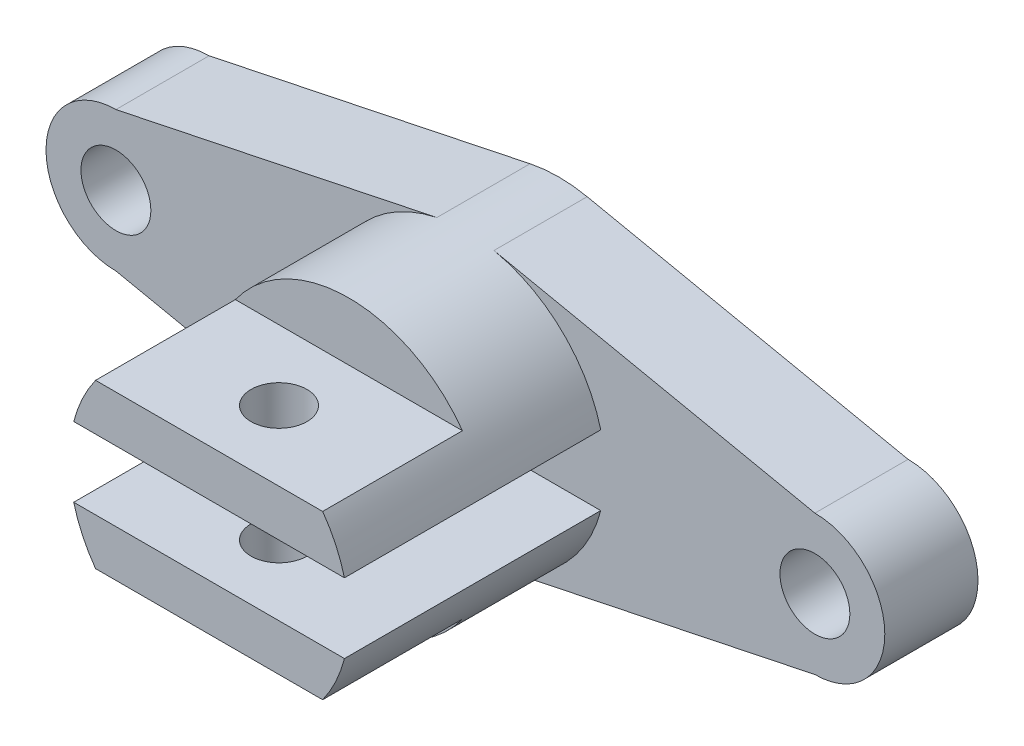
ISO-10303-21;
HEADER;
FILE_DESCRIPTION(('STEP AP214'),'2;1');
FILE_NAME('part.step','',(''),(''),'','','');
FILE_SCHEMA(('AUTOMOTIVE_DESIGN { 1 0 10303 214 1 1 1 1 }'));
ENDSEC;
DATA;
#1=APPLICATION_CONTEXT('core data for automotive mechanical design processes');
#2=APPLICATION_PROTOCOL_DEFINITION('international standard','automotive_design',2000,#1);
#3=PRODUCT_CONTEXT('',#1,'mechanical');
#4=PRODUCT('Part','Part','',(#3));
#5=PRODUCT_RELATED_PRODUCT_CATEGORY('part','',(#4));
#6=PRODUCT_DEFINITION_FORMATION('','',#4);
#7=PRODUCT_DEFINITION_CONTEXT('part definition',#1,'design');
#8=PRODUCT_DEFINITION('design','',#6,#7);
#9=PRODUCT_DEFINITION_SHAPE('','',#8);
#10=(LENGTH_UNIT() NAMED_UNIT(*) SI_UNIT(.MILLI.,.METRE.));
#11=(NAMED_UNIT(*) PLANE_ANGLE_UNIT() SI_UNIT($,.RADIAN.));
#12=(NAMED_UNIT(*) SI_UNIT($,.STERADIAN.) SOLID_ANGLE_UNIT());
#13=UNCERTAINTY_MEASURE_WITH_UNIT(LENGTH_MEASURE(1.E-05),#10,'distance_accuracy_value','');
#14=(GEOMETRIC_REPRESENTATION_CONTEXT(3) GLOBAL_UNCERTAINTY_ASSIGNED_CONTEXT((#13)) GLOBAL_UNIT_ASSIGNED_CONTEXT((#10,
#11,#12)) REPRESENTATION_CONTEXT('',''));
#15=CARTESIAN_POINT('',(0.,0.,0.));
#16=DIRECTION('',(0.,0.,1.));
#17=DIRECTION('',(1.,0.,0.));
#18=AXIS2_PLACEMENT_3D('',#15,#16,#17);
#19=CARTESIAN_POINT('',(-6.12644335404989,29.3677832297506,20.));
#20=DIRECTION('',(-0.20421477846833,0.978926107658352,0.));
#21=DIRECTION('',(-0.978926107658352,-0.20421477846833,0.));
#22=AXIS2_PLACEMENT_3D('',#19,#20,#21);
#23=PLANE('',#22);
#24=DIRECTION('',(0.978926107658352,0.20421477846833,0.));
#25=VECTOR('',#24,1.);
#26=CARTESIAN_POINT('',(-6.12644335404989,29.3677832297506,0.));
#27=LINE('',#26,#25);
#28=CARTESIAN_POINT('',(-75.,15.,0.));
#29=VERTEX_POINT('',#28);
#30=CARTESIAN_POINT('',(-6.12644335404989,29.3677832297506,0.));
#31=VERTEX_POINT('',#30);
#32=EDGE_CURVE('E222',#29,#31,#27,.T.);
#33=ORIENTED_EDGE('',*,*,#32,.F.);
#34=DIRECTION('',(0.,0.,-1.));
#35=VECTOR('',#34,1.);
#36=CARTESIAN_POINT('',(-75.,15.,20.));
#37=LINE('',#36,#35);
#38=CARTESIAN_POINT('',(-75.,15.,20.));
#39=VERTEX_POINT('',#38);
#40=EDGE_CURVE('E56',#39,#29,#37,.T.);
#41=ORIENTED_EDGE('',*,*,#40,.F.);
#42=DIRECTION('',(0.978926107658352,0.20421477846833,0.));
#43=VECTOR('',#42,1.);
#44=CARTESIAN_POINT('',(-6.12644335404989,29.3677832297506,20.));
#45=LINE('',#44,#43);
#46=CARTESIAN_POINT('',(-6.12644335404989,29.3677832297506,20.));
#47=VERTEX_POINT('',#46);
#48=EDGE_CURVE('E232',#39,#47,#45,.T.);
#49=ORIENTED_EDGE('',*,*,#48,.T.);
#50=DIRECTION('',(0.,0.,-1.));
#51=VECTOR('',#50,1.);
#52=CARTESIAN_POINT('',(-6.12644335404989,29.3677832297506,20.));
#53=LINE('',#52,#51);
#54=EDGE_CURVE('E11',#47,#31,#53,.T.);
#55=ORIENTED_EDGE('',*,*,#54,.T.);
#56=EDGE_LOOP('',(#33,#41,#49,#55));
#57=FACE_BOUND('',#56,.T.);
#58=ADVANCED_FACE('F46',(#57),#23,.T.);
#59=CARTESIAN_POINT('',(-75.,0.,20.));
#60=DIRECTION('',(0.,0.,-1.));
#61=DIRECTION('',(-1.,0.,0.));
#62=AXIS2_PLACEMENT_3D('',#59,#60,#61);
#63=CYLINDRICAL_SURFACE('',#62,15.);
#64=CARTESIAN_POINT('',(-75.,0.,0.));
#65=DIRECTION('',(0.,0.,1.));
#66=DIRECTION('',(1.,0.,0.));
#67=AXIS2_PLACEMENT_3D('',#64,#65,#66);
#68=CIRCLE('',#67,15.);
#69=CARTESIAN_POINT('',(-75.,-15.,0.));
#70=VERTEX_POINT('',#69);
#71=EDGE_CURVE('E261',#29,#70,#68,.T.);
#72=ORIENTED_EDGE('',*,*,#71,.T.);
#73=DIRECTION('',(0.,0.,-1.));
#74=VECTOR('',#73,1.);
#75=CARTESIAN_POINT('',(-75.,-15.,20.));
#76=LINE('',#75,#74);
#77=CARTESIAN_POINT('',(-75.,-15.,20.));
#78=VERTEX_POINT('',#77);
#79=EDGE_CURVE('E299',#78,#70,#76,.T.);
#80=ORIENTED_EDGE('',*,*,#79,.F.);
#81=CARTESIAN_POINT('',(-75.,0.,20.));
#82=DIRECTION('',(0.,0.,1.));
#83=DIRECTION('',(1.,0.,0.));
#84=AXIS2_PLACEMENT_3D('',#81,#82,#83);
#85=CIRCLE('',#84,15.);
#86=EDGE_CURVE('E236',#39,#78,#85,.T.);
#87=ORIENTED_EDGE('',*,*,#86,.F.);
#88=ORIENTED_EDGE('',*,*,#40,.T.);
#89=EDGE_LOOP('',(#72,#80,#87,#88));
#90=FACE_BOUND('',#89,.T.);
#91=ADVANCED_FACE('F307',(#90),#63,.T.);
#92=CARTESIAN_POINT('',(-6.12644335404988,-29.3677832297505,20.));
#93=DIRECTION('',(0.204214778468329,0.978926107658352,0.));
#94=DIRECTION('',(-0.978926107658352,0.204214778468329,0.));
#95=AXIS2_PLACEMENT_3D('',#92,#93,#94);
#96=PLANE('',#95);
#97=DIRECTION('',(0.978926107658352,-0.204214778468329,0.));
#98=VECTOR('',#97,1.);
#99=CARTESIAN_POINT('',(-6.12644335404988,-29.3677832297505,0.));
#100=LINE('',#99,#98);
#101=CARTESIAN_POINT('',(-6.12644335404989,-29.3677832297505,0.));
#102=VERTEX_POINT('',#101);
#103=EDGE_CURVE('E264',#70,#102,#100,.T.);
#104=ORIENTED_EDGE('',*,*,#103,.T.);
#105=DIRECTION('',(0.,0.,-1.));
#106=VECTOR('',#105,1.);
#107=CARTESIAN_POINT('',(-6.12644335404989,-29.3677832297505,20.));
#108=LINE('',#107,#106);
#109=CARTESIAN_POINT('',(-6.12644335404988,-29.3677832297505,20.));
#110=VERTEX_POINT('',#109);
#111=EDGE_CURVE('E295',#110,#102,#108,.T.);
#112=ORIENTED_EDGE('',*,*,#111,.F.);
#113=DIRECTION('',(0.978926107658352,-0.204214778468329,0.));
#114=VECTOR('',#113,1.);
#115=CARTESIAN_POINT('',(-6.12644335404988,-29.3677832297505,20.));
#116=LINE('',#115,#114);
#117=EDGE_CURVE('E239',#78,#110,#116,.T.);
#118=ORIENTED_EDGE('',*,*,#117,.F.);
#119=ORIENTED_EDGE('',*,*,#79,.T.);
#120=EDGE_LOOP('',(#104,#112,#118,#119));
#121=FACE_BOUND('',#120,.T.);
#122=ADVANCED_FACE('F385',(#121),#96,.F.);
#123=CARTESIAN_POINT('',(6.12644335404989,-29.3677832297506,20.));
#124=DIRECTION('',(0.20421477846833,-0.978926107658352,0.));
#125=DIRECTION('',(0.978926107658352,0.20421477846833,0.));
#126=AXIS2_PLACEMENT_3D('',#123,#124,#125);
#127=PLANE('',#126);
#128=DIRECTION('',(-0.978926107658352,-0.20421477846833,0.));
#129=VECTOR('',#128,1.);
#130=CARTESIAN_POINT('',(6.12644335404989,-29.3677832297506,0.));
#131=LINE('',#130,#129);
#132=CARTESIAN_POINT('',(75.,-15.,0.));
#133=VERTEX_POINT('',#132);
#134=CARTESIAN_POINT('',(6.12644335404989,-29.3677832297506,0.));
#135=VERTEX_POINT('',#134);
#136=EDGE_CURVE('E268',#133,#135,#131,.T.);
#137=ORIENTED_EDGE('',*,*,#136,.F.);
#138=DIRECTION('',(0.,0.,-1.));
#139=VECTOR('',#138,1.);
#140=CARTESIAN_POINT('',(75.,-15.,20.));
#141=LINE('',#140,#139);
#142=CARTESIAN_POINT('',(75.,-15.,20.));
#143=VERTEX_POINT('',#142);
#144=EDGE_CURVE('E290',#143,#133,#141,.T.);
#145=ORIENTED_EDGE('',*,*,#144,.F.);
#146=DIRECTION('',(-0.978926107658352,-0.20421477846833,0.));
#147=VECTOR('',#146,1.);
#148=CARTESIAN_POINT('',(6.12644335404989,-29.3677832297506,20.));
#149=LINE('',#148,#147);
#150=CARTESIAN_POINT('',(6.12644335404989,-29.3677832297506,20.));
#151=VERTEX_POINT('',#150);
#152=EDGE_CURVE('E136',#143,#151,#149,.T.);
#153=ORIENTED_EDGE('',*,*,#152,.T.);
#154=DIRECTION('',(0.,0.,-1.));
#155=VECTOR('',#154,1.);
#156=CARTESIAN_POINT('',(6.12644335404989,-29.3677832297506,20.));
#157=LINE('',#156,#155);
#158=EDGE_CURVE('E133',#151,#135,#157,.T.);
#159=ORIENTED_EDGE('',*,*,#158,.T.);
#160=EDGE_LOOP('',(#137,#145,#153,#159));
#161=FACE_BOUND('',#160,.T.);
#162=ADVANCED_FACE('F389',(#161),#127,.T.);
#163=CARTESIAN_POINT('',(75.,0.,20.));
#164=DIRECTION('',(0.,0.,-1.));
#165=DIRECTION('',(-1.,0.,0.));
#166=AXIS2_PLACEMENT_3D('',#163,#164,#165);
#167=CYLINDRICAL_SURFACE('',#166,15.);
#168=CARTESIAN_POINT('',(75.,0.,0.));
#169=DIRECTION('',(0.,0.,1.));
#170=DIRECTION('',(1.,0.,0.));
#171=AXIS2_PLACEMENT_3D('',#168,#169,#170);
#172=CIRCLE('',#171,15.);
#173=CARTESIAN_POINT('',(75.,15.,0.));
#174=VERTEX_POINT('',#173);
#175=EDGE_CURVE('E87',#133,#174,#172,.T.);
#176=ORIENTED_EDGE('',*,*,#175,.T.);
#177=DIRECTION('',(0.,0.,-1.));
#178=VECTOR('',#177,1.);
#179=CARTESIAN_POINT('',(75.,15.,20.));
#180=LINE('',#179,#178);
#181=CARTESIAN_POINT('',(75.,15.,20.));
#182=VERTEX_POINT('',#181);
#183=EDGE_CURVE('E287',#182,#174,#180,.T.);
#184=ORIENTED_EDGE('',*,*,#183,.F.);
#185=CARTESIAN_POINT('',(75.,0.,20.));
#186=DIRECTION('',(0.,0.,1.));
#187=DIRECTION('',(1.,0.,0.));
#188=AXIS2_PLACEMENT_3D('',#185,#186,#187);
#189=CIRCLE('',#188,15.);
#190=EDGE_CURVE('E64',#143,#182,#189,.T.);
#191=ORIENTED_EDGE('',*,*,#190,.F.);
#192=ORIENTED_EDGE('',*,*,#144,.T.);
#193=EDGE_LOOP('',(#176,#184,#191,#192));
#194=FACE_BOUND('',#193,.T.);
#195=ADVANCED_FACE('F395',(#194),#167,.T.);
#196=CARTESIAN_POINT('',(-75.,0.,20.));
#197=DIRECTION('',(0.,0.,-1.));
#198=DIRECTION('',(-1.,0.,0.));
#199=AXIS2_PLACEMENT_3D('',#196,#197,#198);
#200=CYLINDRICAL_SURFACE('',#199,7.5);
#201=CARTESIAN_POINT('',(-75.,0.,20.));
#202=DIRECTION('',(0.,0.,1.));
#203=DIRECTION('',(1.,0.,0.));
#204=AXIS2_PLACEMENT_3D('',#201,#202,#203);
#205=CIRCLE('',#204,7.5);
#206=CARTESIAN_POINT('',(-67.5,0.,20.));
#207=VERTEX_POINT('',#206);
#208=EDGE_CURVE('E250',#207,#207,#205,.T.);
#209=ORIENTED_EDGE('',*,*,#208,.T.);
#210=EDGE_LOOP('',(#209));
#211=FACE_BOUND('',#210,.T.);
#212=CARTESIAN_POINT('',(-75.,0.,0.));
#213=DIRECTION('',(0.,0.,1.));
#214=DIRECTION('',(1.,0.,0.));
#215=AXIS2_PLACEMENT_3D('',#212,#213,#214);
#216=CIRCLE('',#215,7.5);
#217=CARTESIAN_POINT('',(-67.5,0.,0.));
#218=VERTEX_POINT('',#217);
#219=EDGE_CURVE('E278',#218,#218,#216,.T.);
#220=ORIENTED_EDGE('',*,*,#219,.F.);
#221=EDGE_LOOP('',(#220));
#222=FACE_BOUND('',#221,.T.);
#223=ADVANCED_FACE('F398',(#211,#222),#200,.F.);
#224=CARTESIAN_POINT('',(6.12644335404989,29.3677832297506,20.));
#225=DIRECTION('',(-0.20421477846833,-0.978926107658352,0.));
#226=DIRECTION('',(0.978926107658352,-0.20421477846833,0.));
#227=AXIS2_PLACEMENT_3D('',#224,#225,#226);
#228=PLANE('',#227);
#229=DIRECTION('',(-0.978926107658352,0.20421477846833,0.));
#230=VECTOR('',#229,1.);
#231=CARTESIAN_POINT('',(6.12644335404989,29.3677832297506,0.));
#232=LINE('',#231,#230);
#233=CARTESIAN_POINT('',(6.12644335404989,29.3677832297506,0.));
#234=VERTEX_POINT('',#233);
#235=EDGE_CURVE('E274',#174,#234,#232,.T.);
#236=ORIENTED_EDGE('',*,*,#235,.T.);
#237=DIRECTION('',(0.,0.,-1.));
#238=VECTOR('',#237,1.);
#239=CARTESIAN_POINT('',(6.12644335404989,29.3677832297506,20.));
#240=LINE('',#239,#238);
#241=CARTESIAN_POINT('',(6.12644335404989,29.3677832297506,20.));
#242=VERTEX_POINT('',#241);
#243=EDGE_CURVE('E258',#242,#234,#240,.T.);
#244=ORIENTED_EDGE('',*,*,#243,.F.);
#245=DIRECTION('',(-0.978926107658352,0.20421477846833,0.));
#246=VECTOR('',#245,1.);
#247=CARTESIAN_POINT('',(6.12644335404989,29.3677832297506,20.));
#248=LINE('',#247,#246);
#249=EDGE_CURVE('E247',#182,#242,#248,.T.);
#250=ORIENTED_EDGE('',*,*,#249,.F.);
#251=ORIENTED_EDGE('',*,*,#183,.T.);
#252=EDGE_LOOP('',(#236,#244,#250,#251));
#253=FACE_BOUND('',#252,.T.);
#254=ADVANCED_FACE('F399',(#253),#228,.F.);
#255=CARTESIAN_POINT('',(75.,0.,20.));
#256=DIRECTION('',(0.,0.,-1.));
#257=DIRECTION('',(-1.,0.,0.));
#258=AXIS2_PLACEMENT_3D('',#255,#256,#257);
#259=CYLINDRICAL_SURFACE('',#258,7.5);
#260=CARTESIAN_POINT('',(75.,0.,20.));
#261=DIRECTION('',(0.,0.,1.));
#262=DIRECTION('',(1.,0.,0.));
#263=AXIS2_PLACEMENT_3D('',#260,#261,#262);
#264=CIRCLE('',#263,7.5);
#265=CARTESIAN_POINT('',(82.5,0.,20.));
#266=VERTEX_POINT('',#265);
#267=EDGE_CURVE('E254',#266,#266,#264,.T.);
#268=ORIENTED_EDGE('',*,*,#267,.T.);
#269=EDGE_LOOP('',(#268));
#270=FACE_BOUND('',#269,.T.);
#271=CARTESIAN_POINT('',(75.,0.,0.));
#272=DIRECTION('',(0.,0.,1.));
#273=DIRECTION('',(1.,0.,0.));
#274=AXIS2_PLACEMENT_3D('',#271,#272,#273);
#275=CIRCLE('',#274,7.5);
#276=CARTESIAN_POINT('',(82.5,0.,0.));
#277=VERTEX_POINT('',#276);
#278=EDGE_CURVE('E228',#277,#277,#275,.T.);
#279=ORIENTED_EDGE('',*,*,#278,.F.);
#280=EDGE_LOOP('',(#279));
#281=FACE_BOUND('',#280,.T.);
#282=ADVANCED_FACE('F402',(#270,#281),#259,.F.);
#283=CARTESIAN_POINT('',(0.,0.,20.));
#284=DIRECTION('',(0.,0.,1.));
#285=DIRECTION('',(1.,0.,0.));
#286=AXIS2_PLACEMENT_3D('',#283,#284,#285);
#287=PLANE('',#286);
#288=CARTESIAN_POINT('',(0.,0.,20.));
#289=DIRECTION('',(0.,0.,1.));
#290=DIRECTION('',(1.,0.,0.));
#291=AXIS2_PLACEMENT_3D('',#288,#289,#290);
#292=CIRCLE('',#291,30.);
#293=CARTESIAN_POINT('',(29.0473750965556,7.5,20.));
#294=VERTEX_POINT('',#293);
#295=EDGE_CURVE('E102',#294,#242,#292,.T.);
#296=ORIENTED_EDGE('',*,*,#295,.F.);
#297=DIRECTION('',(1.,0.,0.));
#298=VECTOR('',#297,1.);
#299=CARTESIAN_POINT('',(0.,7.5,20.));
#300=LINE('',#299,#298);
#301=CARTESIAN_POINT('',(-29.0473750965556,7.5,20.));
#302=VERTEX_POINT('',#301);
#303=EDGE_CURVE('E227',#302,#294,#300,.T.);
#304=ORIENTED_EDGE('',*,*,#303,.F.);
#305=EDGE_CURVE('E229',#47,#302,#292,.T.);
#306=ORIENTED_EDGE('',*,*,#305,.F.);
#307=ORIENTED_EDGE('',*,*,#48,.F.);
#308=ORIENTED_EDGE('',*,*,#86,.T.);
#309=ORIENTED_EDGE('',*,*,#117,.T.);
#310=CARTESIAN_POINT('',(0.,0.,20.));
#311=DIRECTION('',(0.,0.,1.));
#312=DIRECTION('',(1.,0.,0.));
#313=AXIS2_PLACEMENT_3D('',#310,#311,#312);
#314=CIRCLE('',#313,30.);
#315=CARTESIAN_POINT('',(-29.0473750965556,-7.5,20.));
#316=VERTEX_POINT('',#315);
#317=EDGE_CURVE('E139',#316,#110,#314,.T.);
#318=ORIENTED_EDGE('',*,*,#317,.F.);
#319=DIRECTION('',(1.,0.,0.));
#320=VECTOR('',#319,1.);
#321=CARTESIAN_POINT('',(0.,-7.5,20.));
#322=LINE('',#321,#320);
#323=CARTESIAN_POINT('',(29.0473750965556,-7.5,20.));
#324=VERTEX_POINT('',#323);
#325=EDGE_CURVE('E137',#316,#324,#322,.T.);
#326=ORIENTED_EDGE('',*,*,#325,.T.);
#327=EDGE_CURVE('E122',#151,#324,#314,.T.);
#328=ORIENTED_EDGE('',*,*,#327,.F.);
#329=ORIENTED_EDGE('',*,*,#152,.F.);
#330=ORIENTED_EDGE('',*,*,#190,.T.);
#331=ORIENTED_EDGE('',*,*,#249,.T.);
#332=EDGE_LOOP('',(#296,#304,#306,#307,#308,#309,#318,#326,#328,#329,#330,#331));
#333=FACE_BOUND('',#332,.T.);
#334=ORIENTED_EDGE('',*,*,#208,.F.);
#335=EDGE_LOOP('',(#334));
#336=FACE_BOUND('',#335,.T.);
#337=ORIENTED_EDGE('',*,*,#267,.F.);
#338=EDGE_LOOP('',(#337));
#339=FACE_BOUND('',#338,.T.);
#340=ADVANCED_FACE('F141',(#333,#336,#339),#287,.T.);
#341=CARTESIAN_POINT('',(0.,0.,0.));
#342=DIRECTION('',(0.,0.,1.));
#343=DIRECTION('',(1.,0.,0.));
#344=AXIS2_PLACEMENT_3D('',#341,#342,#343);
#345=PLANE('',#344);
#346=ORIENTED_EDGE('',*,*,#32,.T.);
#347=CARTESIAN_POINT('',(0.,0.,0.));
#348=DIRECTION('',(0.,0.,1.));
#349=DIRECTION('',(1.,0.,0.));
#350=AXIS2_PLACEMENT_3D('',#347,#348,#349);
#351=CIRCLE('',#350,30.);
#352=EDGE_CURVE('E95',#234,#31,#351,.T.);
#353=ORIENTED_EDGE('',*,*,#352,.F.);
#354=ORIENTED_EDGE('',*,*,#235,.F.);
#355=ORIENTED_EDGE('',*,*,#175,.F.);
#356=ORIENTED_EDGE('',*,*,#136,.T.);
#357=CARTESIAN_POINT('',(0.,0.,0.));
#358=DIRECTION('',(0.,0.,1.));
#359=DIRECTION('',(1.,0.,0.));
#360=AXIS2_PLACEMENT_3D('',#357,#358,#359);
#361=CIRCLE('',#360,30.);
#362=EDGE_CURVE('E203',#102,#135,#361,.T.);
#363=ORIENTED_EDGE('',*,*,#362,.F.);
#364=ORIENTED_EDGE('',*,*,#103,.F.);
#365=ORIENTED_EDGE('',*,*,#71,.F.);
#366=EDGE_LOOP('',(#346,#353,#354,#355,#356,#363,#364,#365));
#367=FACE_BOUND('',#366,.T.);
#368=ORIENTED_EDGE('',*,*,#219,.T.);
#369=EDGE_LOOP('',(#368));
#370=FACE_BOUND('',#369,.T.);
#371=ORIENTED_EDGE('',*,*,#278,.T.);
#372=EDGE_LOOP('',(#371));
#373=FACE_BOUND('',#372,.T.);
#374=ADVANCED_FACE('F313',(#367,#370,#373),#345,.F.);
#375=CARTESIAN_POINT('',(0.,0.,45.));
#376=DIRECTION('',(0.,0.,-1.));
#377=DIRECTION('',(-1.,0.,0.));
#378=AXIS2_PLACEMENT_3D('',#375,#376,#377);
#379=CYLINDRICAL_SURFACE('',#378,30.);
#380=ORIENTED_EDGE('',*,*,#352,.T.);
#381=ORIENTED_EDGE('',*,*,#54,.F.);
#382=ORIENTED_EDGE('',*,*,#305,.T.);
#383=DIRECTION('',(0.,0.,-1.));
#384=VECTOR('',#383,1.);
#385=CARTESIAN_POINT('',(-29.0473750965556,7.5,75.));
#386=LINE('',#385,#384);
#387=CARTESIAN_POINT('',(-29.0473750965556,7.5,75.));
#388=VERTEX_POINT('',#387);
#389=EDGE_CURVE('E187',#388,#302,#386,.T.);
#390=ORIENTED_EDGE('',*,*,#389,.F.);
#391=CARTESIAN_POINT('',(0.,0.,75.));
#392=DIRECTION('',(0.,0.,1.));
#393=DIRECTION('',(1.,0.,0.));
#394=AXIS2_PLACEMENT_3D('',#391,#392,#393);
#395=CIRCLE('',#394,30.);
#396=CARTESIAN_POINT('',(-24.3669858620224,17.5,75.));
#397=VERTEX_POINT('',#396);
#398=EDGE_CURVE('E183',#397,#388,#395,.T.);
#399=ORIENTED_EDGE('',*,*,#398,.F.);
#400=DIRECTION('',(0.,0.,-1.));
#401=VECTOR('',#400,1.);
#402=CARTESIAN_POINT('',(-24.3669858620224,17.5,75.));
#403=LINE('',#402,#401);
#404=CARTESIAN_POINT('',(-24.3669858620224,17.5,45.));
#405=VERTEX_POINT('',#404);
#406=EDGE_CURVE('E191',#397,#405,#403,.T.);
#407=ORIENTED_EDGE('',*,*,#406,.T.);
#408=CARTESIAN_POINT('',(0.,0.,45.));
#409=DIRECTION('',(0.,0.,1.));
#410=DIRECTION('',(1.,0.,0.));
#411=AXIS2_PLACEMENT_3D('',#408,#409,#410);
#412=CIRCLE('',#411,30.);
#413=CARTESIAN_POINT('',(24.3669858620224,17.5,45.));
#414=VERTEX_POINT('',#413);
#415=EDGE_CURVE('E218',#414,#405,#412,.T.);
#416=ORIENTED_EDGE('',*,*,#415,.F.);
#417=DIRECTION('',(0.,0.,-1.));
#418=VECTOR('',#417,1.);
#419=CARTESIAN_POINT('',(24.3669858620224,17.5,75.));
#420=LINE('',#419,#418);
#421=CARTESIAN_POINT('',(24.3669858620224,17.5,75.));
#422=VERTEX_POINT('',#421);
#423=EDGE_CURVE('E195',#422,#414,#420,.T.);
#424=ORIENTED_EDGE('',*,*,#423,.F.);
#425=CARTESIAN_POINT('',(29.0473750965556,7.5,75.));
#426=VERTEX_POINT('',#425);
#427=EDGE_CURVE('E178',#426,#422,#395,.T.);
#428=ORIENTED_EDGE('',*,*,#427,.F.);
#429=DIRECTION('',(0.,0.,-1.));
#430=VECTOR('',#429,1.);
#431=CARTESIAN_POINT('',(29.0473750965556,7.5,75.));
#432=LINE('',#431,#430);
#433=EDGE_CURVE('E199',#426,#294,#432,.T.);
#434=ORIENTED_EDGE('',*,*,#433,.T.);
#435=ORIENTED_EDGE('',*,*,#295,.T.);
#436=ORIENTED_EDGE('',*,*,#243,.T.);
#437=EDGE_LOOP('',(#380,#381,#382,#390,#399,#407,#416,#424,#428,#434,#435,#436));
#438=FACE_BOUND('',#437,.T.);
#439=ADVANCED_FACE('F322',(#438),#379,.T.);
#440=CARTESIAN_POINT('',(0.,0.,45.));
#441=DIRECTION('',(0.,0.,1.));
#442=DIRECTION('',(1.,0.,0.));
#443=AXIS2_PLACEMENT_3D('',#440,#441,#442);
#444=PLANE('',#443);
#445=DIRECTION('',(-1.,0.,0.));
#446=VECTOR('',#445,1.);
#447=CARTESIAN_POINT('',(0.,17.5,45.));
#448=LINE('',#447,#446);
#449=EDGE_CURVE('E214',#414,#405,#448,.T.);
#450=ORIENTED_EDGE('',*,*,#449,.F.);
#451=ORIENTED_EDGE('',*,*,#415,.T.);
#452=EDGE_LOOP('',(#450,#451));
#453=FACE_BOUND('',#452,.T.);
#454=ADVANCED_FACE('F362',(#453),#444,.T.);
#455=CARTESIAN_POINT('',(0.,0.,45.));
#456=DIRECTION('',(0.,0.,-1.));
#457=DIRECTION('',(-1.,0.,0.));
#458=AXIS2_PLACEMENT_3D('',#455,#456,#457);
#459=CYLINDRICAL_SURFACE('',#458,30.);
#460=ORIENTED_EDGE('',*,*,#362,.T.);
#461=ORIENTED_EDGE('',*,*,#158,.F.);
#462=ORIENTED_EDGE('',*,*,#327,.T.);
#463=DIRECTION('',(0.,0.,-1.));
#464=VECTOR('',#463,1.);
#465=CARTESIAN_POINT('',(29.0473750965556,-7.5,75.));
#466=LINE('',#465,#464);
#467=CARTESIAN_POINT('',(29.0473750965556,-7.5,75.));
#468=VERTEX_POINT('',#467);
#469=EDGE_CURVE('E129',#468,#324,#466,.T.);
#470=ORIENTED_EDGE('',*,*,#469,.F.);
#471=CARTESIAN_POINT('',(0.,0.,75.));
#472=DIRECTION('',(0.,0.,1.));
#473=DIRECTION('',(1.,0.,0.));
#474=AXIS2_PLACEMENT_3D('',#471,#472,#473);
#475=CIRCLE('',#474,30.);
#476=CARTESIAN_POINT('',(24.3669858620224,-17.5,75.));
#477=VERTEX_POINT('',#476);
#478=EDGE_CURVE('E155',#477,#468,#475,.T.);
#479=ORIENTED_EDGE('',*,*,#478,.F.);
#480=DIRECTION('',(0.,0.,-1.));
#481=VECTOR('',#480,1.);
#482=CARTESIAN_POINT('',(24.3669858620224,-17.5,75.));
#483=LINE('',#482,#481);
#484=CARTESIAN_POINT('',(24.3669858620224,-17.5,45.));
#485=VERTEX_POINT('',#484);
#486=EDGE_CURVE('E154',#477,#485,#483,.T.);
#487=ORIENTED_EDGE('',*,*,#486,.T.);
#488=CARTESIAN_POINT('',(0.,0.,45.));
#489=DIRECTION('',(0.,0.,1.));
#490=DIRECTION('',(1.,0.,0.));
#491=AXIS2_PLACEMENT_3D('',#488,#489,#490);
#492=CIRCLE('',#491,30.);
#493=CARTESIAN_POINT('',(-24.3669858620224,-17.5,45.));
#494=VERTEX_POINT('',#493);
#495=EDGE_CURVE('E208',#494,#485,#492,.T.);
#496=ORIENTED_EDGE('',*,*,#495,.F.);
#497=DIRECTION('',(0.,0.,-1.));
#498=VECTOR('',#497,1.);
#499=CARTESIAN_POINT('',(-24.3669858620224,-17.5,75.));
#500=LINE('',#499,#498);
#501=CARTESIAN_POINT('',(-24.3669858620224,-17.5,75.));
#502=VERTEX_POINT('',#501);
#503=EDGE_CURVE('E160',#502,#494,#500,.T.);
#504=ORIENTED_EDGE('',*,*,#503,.F.);
#505=CARTESIAN_POINT('',(-29.0473750965556,-7.5,75.));
#506=VERTEX_POINT('',#505);
#507=EDGE_CURVE('E165',#506,#502,#475,.T.);
#508=ORIENTED_EDGE('',*,*,#507,.F.);
#509=DIRECTION('',(0.,0.,-1.));
#510=VECTOR('',#509,1.);
#511=CARTESIAN_POINT('',(-29.0473750965556,-7.5,75.));
#512=LINE('',#511,#510);
#513=EDGE_CURVE('E171',#506,#316,#512,.T.);
#514=ORIENTED_EDGE('',*,*,#513,.T.);
#515=ORIENTED_EDGE('',*,*,#317,.T.);
#516=ORIENTED_EDGE('',*,*,#111,.T.);
#517=EDGE_LOOP('',(#460,#461,#462,#470,#479,#487,#496,#504,#508,#514,#515,#516));
#518=FACE_BOUND('',#517,.T.);
#519=ADVANCED_FACE('F125',(#518),#459,.T.);
#520=CARTESIAN_POINT('',(0.,0.,45.));
#521=DIRECTION('',(0.,0.,1.));
#522=DIRECTION('',(1.,0.,0.));
#523=AXIS2_PLACEMENT_3D('',#520,#521,#522);
#524=PLANE('',#523);
#525=DIRECTION('',(1.,0.,0.));
#526=VECTOR('',#525,1.);
#527=CARTESIAN_POINT('',(0.,-17.5,45.));
#528=LINE('',#527,#526);
#529=EDGE_CURVE('E204',#494,#485,#528,.T.);
#530=ORIENTED_EDGE('',*,*,#529,.F.);
#531=ORIENTED_EDGE('',*,*,#495,.T.);
#532=EDGE_LOOP('',(#530,#531));
#533=FACE_BOUND('',#532,.T.);
#534=ADVANCED_FACE('F376',(#533),#524,.T.);
#535=CARTESIAN_POINT('',(0.,0.,75.));
#536=DIRECTION('',(0.,0.,1.));
#537=DIRECTION('',(1.,0.,0.));
#538=AXIS2_PLACEMENT_3D('',#535,#536,#537);
#539=PLANE('',#538);
#540=DIRECTION('',(1.,0.,0.));
#541=VECTOR('',#540,1.);
#542=CARTESIAN_POINT('',(0.,7.5,75.));
#543=LINE('',#542,#541);
#544=EDGE_CURVE('E174',#388,#426,#543,.T.);
#545=ORIENTED_EDGE('',*,*,#544,.T.);
#546=ORIENTED_EDGE('',*,*,#427,.T.);
#547=DIRECTION('',(-1.,0.,0.));
#548=VECTOR('',#547,1.);
#549=CARTESIAN_POINT('',(0.,17.5,75.));
#550=LINE('',#549,#548);
#551=EDGE_CURVE('E182',#422,#397,#550,.T.);
#552=ORIENTED_EDGE('',*,*,#551,.T.);
#553=ORIENTED_EDGE('',*,*,#398,.T.);
#554=EDGE_LOOP('',(#545,#546,#552,#553));
#555=FACE_BOUND('',#554,.T.);
#556=ADVANCED_FACE('F330',(#555),#539,.T.);
#557=CARTESIAN_POINT('',(0.,17.5,75.));
#558=DIRECTION('',(0.,-1.,0.));
#559=DIRECTION('',(0.,0.,-1.));
#560=AXIS2_PLACEMENT_3D('',#557,#558,#559);
#561=PLANE('',#560);
#562=CARTESIAN_POINT('',(0.,17.5,60.));
#563=DIRECTION('',(0.,-1.,0.));
#564=DIRECTION('',(0.,0.,-1.));
#565=AXIS2_PLACEMENT_3D('',#562,#563,#564);
#566=CIRCLE('',#565,6.);
#567=CARTESIAN_POINT('',(0.,17.5,54.));
#568=VERTEX_POINT('',#567);
#569=EDGE_CURVE('E443',#568,#568,#566,.T.);
#570=ORIENTED_EDGE('',*,*,#569,.T.);
#571=EDGE_LOOP('',(#570));
#572=FACE_BOUND('',#571,.T.);
#573=ORIENTED_EDGE('',*,*,#449,.T.);
#574=ORIENTED_EDGE('',*,*,#406,.F.);
#575=ORIENTED_EDGE('',*,*,#551,.F.);
#576=ORIENTED_EDGE('',*,*,#423,.T.);
#577=EDGE_LOOP('',(#573,#574,#575,#576));
#578=FACE_BOUND('',#577,.T.);
#579=ADVANCED_FACE('F364',(#572,#578),#561,.F.);
#580=CARTESIAN_POINT('',(0.,7.5,75.));
#581=DIRECTION('',(0.,1.,0.));
#582=DIRECTION('',(0.,0.,1.));
#583=AXIS2_PLACEMENT_3D('',#580,#581,#582);
#584=PLANE('',#583);
#585=CARTESIAN_POINT('',(0.,7.5,60.));
#586=DIRECTION('',(0.,1.,0.));
#587=DIRECTION('',(0.,0.,1.));
#588=AXIS2_PLACEMENT_3D('',#585,#586,#587);
#589=CIRCLE('',#588,6.);
#590=CARTESIAN_POINT('',(0.,7.5,66.));
#591=VERTEX_POINT('',#590);
#592=EDGE_CURVE('E448',#591,#591,#589,.T.);
#593=ORIENTED_EDGE('',*,*,#592,.T.);
#594=EDGE_LOOP('',(#593));
#595=FACE_BOUND('',#594,.T.);
#596=ORIENTED_EDGE('',*,*,#303,.T.);
#597=ORIENTED_EDGE('',*,*,#433,.F.);
#598=ORIENTED_EDGE('',*,*,#544,.F.);
#599=ORIENTED_EDGE('',*,*,#389,.T.);
#600=EDGE_LOOP('',(#596,#597,#598,#599));
#601=FACE_BOUND('',#600,.T.);
#602=ADVANCED_FACE('F340',(#595,#601),#584,.F.);
#603=CARTESIAN_POINT('',(0.,0.,75.));
#604=DIRECTION('',(0.,0.,1.));
#605=DIRECTION('',(1.,0.,0.));
#606=AXIS2_PLACEMENT_3D('',#603,#604,#605);
#607=PLANE('',#606);
#608=DIRECTION('',(1.,0.,0.));
#609=VECTOR('',#608,1.);
#610=CARTESIAN_POINT('',(0.,-7.5,75.));
#611=LINE('',#610,#609);
#612=EDGE_CURVE('E152',#506,#468,#611,.T.);
#613=ORIENTED_EDGE('',*,*,#612,.F.);
#614=ORIENTED_EDGE('',*,*,#507,.T.);
#615=DIRECTION('',(1.,0.,0.));
#616=VECTOR('',#615,1.);
#617=CARTESIAN_POINT('',(0.,-17.5,75.));
#618=LINE('',#617,#616);
#619=EDGE_CURVE('E163',#502,#477,#618,.T.);
#620=ORIENTED_EDGE('',*,*,#619,.T.);
#621=ORIENTED_EDGE('',*,*,#478,.T.);
#622=EDGE_LOOP('',(#613,#614,#620,#621));
#623=FACE_BOUND('',#622,.T.);
#624=ADVANCED_FACE('F372',(#623),#607,.T.);
#625=CARTESIAN_POINT('',(0.,-17.5,75.));
#626=DIRECTION('',(0.,1.,0.));
#627=DIRECTION('',(0.,0.,1.));
#628=AXIS2_PLACEMENT_3D('',#625,#626,#627);
#629=PLANE('',#628);
#630=CARTESIAN_POINT('',(0.,-17.5,60.));
#631=DIRECTION('',(0.,-1.,0.));
#632=DIRECTION('',(0.,0.,-1.));
#633=AXIS2_PLACEMENT_3D('',#630,#631,#632);
#634=CIRCLE('',#633,6.);
#635=CARTESIAN_POINT('',(0.,-17.5,54.));
#636=VERTEX_POINT('',#635);
#637=EDGE_CURVE('E452',#636,#636,#634,.T.);
#638=ORIENTED_EDGE('',*,*,#637,.F.);
#639=EDGE_LOOP('',(#638));
#640=FACE_BOUND('',#639,.T.);
#641=ORIENTED_EDGE('',*,*,#529,.T.);
#642=ORIENTED_EDGE('',*,*,#486,.F.);
#643=ORIENTED_EDGE('',*,*,#619,.F.);
#644=ORIENTED_EDGE('',*,*,#503,.T.);
#645=EDGE_LOOP('',(#641,#642,#643,#644));
#646=FACE_BOUND('',#645,.T.);
#647=ADVANCED_FACE('F428',(#640,#646),#629,.F.);
#648=CARTESIAN_POINT('',(0.,-7.5,75.));
#649=DIRECTION('',(0.,1.,0.));
#650=DIRECTION('',(0.,0.,1.));
#651=AXIS2_PLACEMENT_3D('',#648,#649,#650);
#652=PLANE('',#651);
#653=CARTESIAN_POINT('',(0.,-7.50000000000001,60.));
#654=DIRECTION('',(0.,1.,0.));
#655=DIRECTION('',(0.,0.,1.));
#656=AXIS2_PLACEMENT_3D('',#653,#654,#655);
#657=CIRCLE('',#656,6.);
#658=CARTESIAN_POINT('',(0.,-7.50000000000001,66.));
#659=VERTEX_POINT('',#658);
#660=EDGE_CURVE('E49',#659,#659,#657,.T.);
#661=ORIENTED_EDGE('',*,*,#660,.F.);
#662=EDGE_LOOP('',(#661));
#663=FACE_BOUND('',#662,.T.);
#664=ORIENTED_EDGE('',*,*,#469,.T.);
#665=ORIENTED_EDGE('',*,*,#325,.F.);
#666=ORIENTED_EDGE('',*,*,#513,.F.);
#667=ORIENTED_EDGE('',*,*,#612,.T.);
#668=EDGE_LOOP('',(#664,#665,#666,#667));
#669=FACE_BOUND('',#668,.T.);
#670=ADVANCED_FACE('F150',(#663,#669),#652,.T.);
#671=CARTESIAN_POINT('',(0.,57.5,60.));
#672=DIRECTION('',(0.,-1.,0.));
#673=DIRECTION('',(0.,0.,-1.));
#674=AXIS2_PLACEMENT_3D('',#671,#672,#673);
#675=CYLINDRICAL_SURFACE('',#674,6.);
#676=ORIENTED_EDGE('',*,*,#660,.T.);
#677=EDGE_LOOP('',(#676));
#678=FACE_BOUND('',#677,.T.);
#679=ORIENTED_EDGE('',*,*,#637,.T.);
#680=EDGE_LOOP('',(#679));
#681=FACE_BOUND('',#680,.T.);
#682=ADVANCED_FACE('F461',(#678,#681),#675,.F.);
#683=ORIENTED_EDGE('',*,*,#592,.F.);
#684=EDGE_LOOP('',(#683));
#685=FACE_BOUND('',#684,.T.);
#686=ORIENTED_EDGE('',*,*,#569,.F.);
#687=EDGE_LOOP('',(#686));
#688=FACE_BOUND('',#687,.T.);
#689=ADVANCED_FACE('F469',(#685,#688),#675,.F.);
#690=CLOSED_SHELL('',(#58,#91,#122,#162,#195,#223,#254,#282,#340,#374,#439,#454,#519,#534,#556,
#579,#602,#624,#647,#670,#682,#689));
#691=MANIFOLD_SOLID_BREP('B2',#690);
#692=ADVANCED_BREP_SHAPE_REPRESENTATION('',(#18,#691),#14);
#693=SHAPE_DEFINITION_REPRESENTATION(#9,#692);
ENDSEC;
END-ISO-10303-21;
